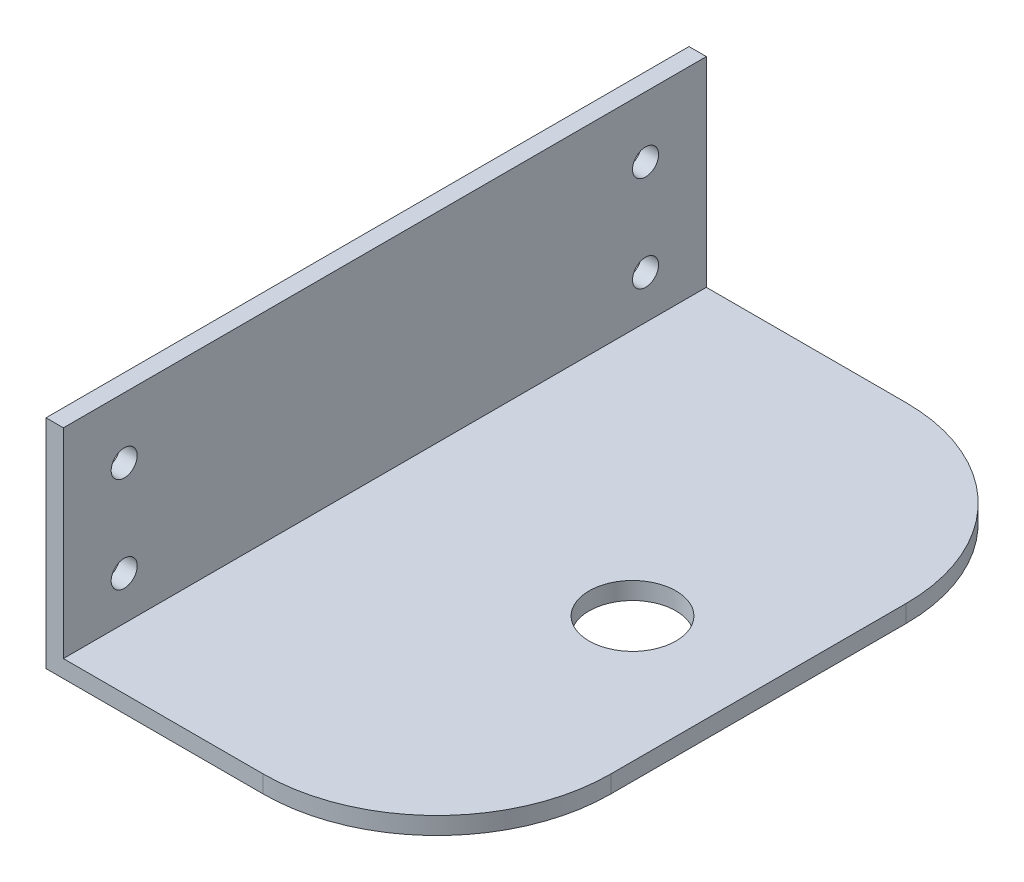
ISO-10303-21;
HEADER;
FILE_DESCRIPTION(('STEP AP214'),'2;1');
FILE_NAME('part.step','',(''),(''),'','','');
FILE_SCHEMA(('AUTOMOTIVE_DESIGN { 1 0 10303 214 1 1 1 1 }'));
ENDSEC;
DATA;
#1=APPLICATION_CONTEXT('core data for automotive mechanical design processes');
#2=APPLICATION_PROTOCOL_DEFINITION('international standard','automotive_design',2000,#1);
#3=PRODUCT_CONTEXT('',#1,'mechanical');
#4=PRODUCT('Part','Part','',(#3));
#5=PRODUCT_RELATED_PRODUCT_CATEGORY('part','',(#4));
#6=PRODUCT_DEFINITION_FORMATION('','',#4);
#7=PRODUCT_DEFINITION_CONTEXT('part definition',#1,'design');
#8=PRODUCT_DEFINITION('design','',#6,#7);
#9=PRODUCT_DEFINITION_SHAPE('','',#8);
#10=(LENGTH_UNIT() NAMED_UNIT(*) SI_UNIT(.MILLI.,.METRE.));
#11=(NAMED_UNIT(*) PLANE_ANGLE_UNIT() SI_UNIT($,.RADIAN.));
#12=(NAMED_UNIT(*) SI_UNIT($,.STERADIAN.) SOLID_ANGLE_UNIT());
#13=UNCERTAINTY_MEASURE_WITH_UNIT(LENGTH_MEASURE(1.E-05),#10,'distance_accuracy_value','');
#14=(GEOMETRIC_REPRESENTATION_CONTEXT(3) GLOBAL_UNCERTAINTY_ASSIGNED_CONTEXT((#13)) GLOBAL_UNIT_ASSIGNED_CONTEXT((#10,
#11,#12)) REPRESENTATION_CONTEXT('',''));
#15=CARTESIAN_POINT('',(0.,0.,0.));
#16=DIRECTION('',(0.,0.,1.));
#17=DIRECTION('',(1.,0.,0.));
#18=AXIS2_PLACEMENT_3D('',#15,#16,#17);
#19=CARTESIAN_POINT('',(0.,2.,0.));
#20=DIRECTION('',(0.,1.,0.));
#21=DIRECTION('',(0.,0.,1.));
#22=AXIS2_PLACEMENT_3D('',#19,#20,#21);
#23=PLANE('',#22);
#24=DIRECTION('',(1.,0.,0.));
#25=VECTOR('',#24,1.);
#26=CARTESIAN_POINT('',(-30.5,2.,37.));
#27=LINE('',#26,#25);
#28=CARTESIAN_POINT('',(-28.5,2.,37.));
#29=VERTEX_POINT('',#28);
#30=CARTESIAN_POINT('',(-5.5,2.,37.));
#31=VERTEX_POINT('',#30);
#32=EDGE_CURVE('E146',#29,#31,#27,.T.);
#33=ORIENTED_EDGE('',*,*,#32,.T.);
#34=CARTESIAN_POINT('',(-5.5,2.,17.));
#35=DIRECTION('',(0.,1.,0.));
#36=DIRECTION('',(0.,0.,1.));
#37=AXIS2_PLACEMENT_3D('',#34,#35,#36);
#38=CIRCLE('',#37,20.);
#39=CARTESIAN_POINT('',(14.5,2.,17.));
#40=VERTEX_POINT('',#39);
#41=EDGE_CURVE('E40',#31,#40,#38,.T.);
#42=ORIENTED_EDGE('',*,*,#41,.T.);
#43=DIRECTION('',(0.,0.,-1.));
#44=VECTOR('',#43,1.);
#45=CARTESIAN_POINT('',(14.5,2.,-37.));
#46=LINE('',#45,#44);
#47=CARTESIAN_POINT('',(14.5,2.,-17.));
#48=VERTEX_POINT('',#47);
#49=EDGE_CURVE('E148',#40,#48,#46,.T.);
#50=ORIENTED_EDGE('',*,*,#49,.T.);
#51=CARTESIAN_POINT('',(-5.5,2.,-17.));
#52=DIRECTION('',(0.,1.,0.));
#53=DIRECTION('',(0.,0.,1.));
#54=AXIS2_PLACEMENT_3D('',#51,#52,#53);
#55=CIRCLE('',#54,20.);
#56=CARTESIAN_POINT('',(-5.50000000000001,2.,-37.));
#57=VERTEX_POINT('',#56);
#58=EDGE_CURVE('E47',#48,#57,#55,.T.);
#59=ORIENTED_EDGE('',*,*,#58,.T.);
#60=DIRECTION('',(-1.,0.,0.));
#61=VECTOR('',#60,1.);
#62=CARTESIAN_POINT('',(-30.5,2.,-37.));
#63=LINE('',#62,#61);
#64=CARTESIAN_POINT('',(-28.5,2.,-37.));
#65=VERTEX_POINT('',#64);
#66=EDGE_CURVE('E151',#57,#65,#63,.T.);
#67=ORIENTED_EDGE('',*,*,#66,.T.);
#68=DIRECTION('',(0.,0.,-1.));
#69=VECTOR('',#68,1.);
#70=CARTESIAN_POINT('',(-28.5,2.,-37.));
#71=LINE('',#70,#69);
#72=EDGE_CURVE('E125',#29,#65,#71,.T.);
#73=ORIENTED_EDGE('',*,*,#72,.F.);
#74=EDGE_LOOP('',(#33,#42,#50,#59,#67,#73));
#75=FACE_BOUND('',#74,.T.);
#76=CARTESIAN_POINT('',(0.,2.,0.));
#77=DIRECTION('',(0.,1.,0.));
#78=DIRECTION('',(0.,0.,1.));
#79=AXIS2_PLACEMENT_3D('',#76,#77,#78);
#80=CIRCLE('',#79,5.);
#81=CARTESIAN_POINT('',(0.,2.,5.));
#82=VERTEX_POINT('',#81);
#83=EDGE_CURVE('E141',#82,#82,#80,.T.);
#84=ORIENTED_EDGE('',*,*,#83,.F.);
#85=EDGE_LOOP('',(#84));
#86=FACE_BOUND('',#85,.T.);
#87=ADVANCED_FACE('F32',(#75,#86),#23,.T.);
#88=CARTESIAN_POINT('',(0.,0.,0.));
#89=DIRECTION('',(0.,1.,0.));
#90=DIRECTION('',(0.,0.,1.));
#91=AXIS2_PLACEMENT_3D('',#88,#89,#90);
#92=PLANE('',#91);
#93=DIRECTION('',(0.,0.,-1.));
#94=VECTOR('',#93,1.);
#95=CARTESIAN_POINT('',(14.5,0.,-37.));
#96=LINE('',#95,#94);
#97=CARTESIAN_POINT('',(14.5,0.,17.));
#98=VERTEX_POINT('',#97);
#99=CARTESIAN_POINT('',(14.5,0.,-17.));
#100=VERTEX_POINT('',#99);
#101=EDGE_CURVE('E156',#98,#100,#96,.T.);
#102=ORIENTED_EDGE('',*,*,#101,.F.);
#103=CARTESIAN_POINT('',(-5.5,0.,17.));
#104=DIRECTION('',(0.,1.,0.));
#105=DIRECTION('',(0.,0.,1.));
#106=AXIS2_PLACEMENT_3D('',#103,#104,#105);
#107=CIRCLE('',#106,20.);
#108=CARTESIAN_POINT('',(-5.5,0.,37.));
#109=VERTEX_POINT('',#108);
#110=EDGE_CURVE('E178',#98,#109,#107,.F.);
#111=ORIENTED_EDGE('',*,*,#110,.T.);
#112=DIRECTION('',(1.,0.,0.));
#113=VECTOR('',#112,1.);
#114=CARTESIAN_POINT('',(-30.5,0.,37.));
#115=LINE('',#114,#113);
#116=CARTESIAN_POINT('',(-30.5,0.,37.));
#117=VERTEX_POINT('',#116);
#118=EDGE_CURVE('E154',#117,#109,#115,.T.);
#119=ORIENTED_EDGE('',*,*,#118,.F.);
#120=DIRECTION('',(0.,0.,1.));
#121=VECTOR('',#120,1.);
#122=CARTESIAN_POINT('',(-30.5,0.,-37.));
#123=LINE('',#122,#121);
#124=CARTESIAN_POINT('',(-30.5,0.,-37.));
#125=VERTEX_POINT('',#124);
#126=EDGE_CURVE('E108',#125,#117,#123,.T.);
#127=ORIENTED_EDGE('',*,*,#126,.F.);
#128=DIRECTION('',(-1.,0.,0.));
#129=VECTOR('',#128,1.);
#130=CARTESIAN_POINT('',(-30.5,0.,-37.));
#131=LINE('',#130,#129);
#132=CARTESIAN_POINT('',(-5.50000000000001,0.,-37.));
#133=VERTEX_POINT('',#132);
#134=EDGE_CURVE('E149',#133,#125,#131,.T.);
#135=ORIENTED_EDGE('',*,*,#134,.F.);
#136=CARTESIAN_POINT('',(-5.5,0.,-17.));
#137=DIRECTION('',(0.,1.,0.));
#138=DIRECTION('',(0.,0.,1.));
#139=AXIS2_PLACEMENT_3D('',#136,#137,#138);
#140=CIRCLE('',#139,20.);
#141=EDGE_CURVE('E176',#133,#100,#140,.F.);
#142=ORIENTED_EDGE('',*,*,#141,.T.);
#143=EDGE_LOOP('',(#102,#111,#119,#127,#135,#142));
#144=FACE_BOUND('',#143,.T.);
#145=CARTESIAN_POINT('',(0.,0.,0.));
#146=DIRECTION('',(0.,1.,0.));
#147=DIRECTION('',(0.,0.,1.));
#148=AXIS2_PLACEMENT_3D('',#145,#146,#147);
#149=CIRCLE('',#148,5.);
#150=CARTESIAN_POINT('',(0.,0.,5.));
#151=VERTEX_POINT('',#150);
#152=EDGE_CURVE('E140',#151,#151,#149,.T.);
#153=ORIENTED_EDGE('',*,*,#152,.T.);
#154=EDGE_LOOP('',(#153));
#155=FACE_BOUND('',#154,.T.);
#156=ADVANCED_FACE('F192',(#144,#155),#92,.F.);
#157=CARTESIAN_POINT('',(-30.5,2.,-37.));
#158=DIRECTION('',(1.,0.,0.));
#159=DIRECTION('',(0.,0.,-1.));
#160=AXIS2_PLACEMENT_3D('',#157,#158,#159);
#161=PLANE('',#160);
#162=CARTESIAN_POINT('',(-30.5,18.,-30.));
#163=DIRECTION('',(1.,0.,0.));
#164=DIRECTION('',(0.,0.,1.));
#165=AXIS2_PLACEMENT_3D('',#162,#163,#164);
#166=CIRCLE('',#165,1.5);
#167=CARTESIAN_POINT('',(-30.5,18.,-28.5));
#168=VERTEX_POINT('',#167);
#169=EDGE_CURVE('E268',#168,#168,#166,.T.);
#170=ORIENTED_EDGE('',*,*,#169,.T.);
#171=EDGE_LOOP('',(#170));
#172=FACE_BOUND('',#171,.T.);
#173=CARTESIAN_POINT('',(-30.5,7.,30.));
#174=DIRECTION('',(1.,0.,0.));
#175=DIRECTION('',(0.,0.,-1.));
#176=AXIS2_PLACEMENT_3D('',#173,#174,#175);
#177=CIRCLE('',#176,1.5);
#178=CARTESIAN_POINT('',(-30.5,7.,28.5));
#179=VERTEX_POINT('',#178);
#180=EDGE_CURVE('E263',#179,#179,#177,.T.);
#181=ORIENTED_EDGE('',*,*,#180,.T.);
#182=EDGE_LOOP('',(#181));
#183=FACE_BOUND('',#182,.T.);
#184=CARTESIAN_POINT('',(-30.5,6.99999999999997,-30.));
#185=DIRECTION('',(1.,0.,0.));
#186=DIRECTION('',(0.,0.,1.));
#187=AXIS2_PLACEMENT_3D('',#184,#185,#186);
#188=CIRCLE('',#187,1.5);
#189=CARTESIAN_POINT('',(-30.5,6.99999999999997,-28.5));
#190=VERTEX_POINT('',#189);
#191=EDGE_CURVE('E261',#190,#190,#188,.T.);
#192=ORIENTED_EDGE('',*,*,#191,.T.);
#193=EDGE_LOOP('',(#192));
#194=FACE_BOUND('',#193,.T.);
#195=CARTESIAN_POINT('',(-30.5,18.,30.));
#196=DIRECTION('',(1.,0.,0.));
#197=DIRECTION('',(0.,0.,-1.));
#198=AXIS2_PLACEMENT_3D('',#195,#196,#197);
#199=CIRCLE('',#198,1.5);
#200=CARTESIAN_POINT('',(-30.5,18.,28.5));
#201=VERTEX_POINT('',#200);
#202=EDGE_CURVE('E131',#201,#201,#199,.T.);
#203=ORIENTED_EDGE('',*,*,#202,.T.);
#204=EDGE_LOOP('',(#203));
#205=FACE_BOUND('',#204,.T.);
#206=ORIENTED_EDGE('',*,*,#126,.T.);
#207=DIRECTION('',(0.,-1.,0.));
#208=VECTOR('',#207,1.);
#209=CARTESIAN_POINT('',(-30.5,2.,37.));
#210=LINE('',#209,#208);
#211=CARTESIAN_POINT('',(-30.5,25.,37.));
#212=VERTEX_POINT('',#211);
#213=EDGE_CURVE('E101',#212,#117,#210,.T.);
#214=ORIENTED_EDGE('',*,*,#213,.F.);
#215=DIRECTION('',(0.,0.,1.));
#216=VECTOR('',#215,1.);
#217=CARTESIAN_POINT('',(-30.5,25.,-37.));
#218=LINE('',#217,#216);
#219=CARTESIAN_POINT('',(-30.5,25.,-37.));
#220=VERTEX_POINT('',#219);
#221=EDGE_CURVE('E106',#220,#212,#218,.T.);
#222=ORIENTED_EDGE('',*,*,#221,.F.);
#223=DIRECTION('',(0.,-1.,0.));
#224=VECTOR('',#223,1.);
#225=CARTESIAN_POINT('',(-30.5,2.,-37.));
#226=LINE('',#225,#224);
#227=EDGE_CURVE('E110',#220,#125,#226,.T.);
#228=ORIENTED_EDGE('',*,*,#227,.T.);
#229=EDGE_LOOP('',(#206,#214,#222,#228));
#230=FACE_BOUND('',#229,.T.);
#231=ADVANCED_FACE('F103',(#172,#183,#194,#205,#230),#161,.F.);
#232=CARTESIAN_POINT('',(-30.5,2.,37.));
#233=DIRECTION('',(0.,0.,-1.));
#234=DIRECTION('',(-1.,0.,0.));
#235=AXIS2_PLACEMENT_3D('',#232,#233,#234);
#236=PLANE('',#235);
#237=ORIENTED_EDGE('',*,*,#118,.T.);
#238=DIRECTION('',(0.,-1.,0.));
#239=VECTOR('',#238,1.);
#240=CARTESIAN_POINT('',(-5.49999999999999,2.,37.));
#241=LINE('',#240,#239);
#242=EDGE_CURVE('E55',#109,#31,#241,.F.);
#243=ORIENTED_EDGE('',*,*,#242,.T.);
#244=ORIENTED_EDGE('',*,*,#32,.F.);
#245=DIRECTION('',(0.,-1.,0.));
#246=VECTOR('',#245,1.);
#247=CARTESIAN_POINT('',(-28.5,25.,37.));
#248=LINE('',#247,#246);
#249=CARTESIAN_POINT('',(-28.5,25.,37.));
#250=VERTEX_POINT('',#249);
#251=EDGE_CURVE('E116',#250,#29,#248,.T.);
#252=ORIENTED_EDGE('',*,*,#251,.F.);
#253=DIRECTION('',(1.,0.,0.));
#254=VECTOR('',#253,1.);
#255=CARTESIAN_POINT('',(-30.5,25.,37.));
#256=LINE('',#255,#254);
#257=EDGE_CURVE('E113',#212,#250,#256,.T.);
#258=ORIENTED_EDGE('',*,*,#257,.F.);
#259=ORIENTED_EDGE('',*,*,#213,.T.);
#260=EDGE_LOOP('',(#237,#243,#244,#252,#258,#259));
#261=FACE_BOUND('',#260,.T.);
#262=ADVANCED_FACE('F114',(#261),#236,.F.);
#263=CARTESIAN_POINT('',(14.5,2.,-37.));
#264=DIRECTION('',(-1.,0.,0.));
#265=DIRECTION('',(0.,0.,1.));
#266=AXIS2_PLACEMENT_3D('',#263,#264,#265);
#267=PLANE('',#266);
#268=ORIENTED_EDGE('',*,*,#49,.F.);
#269=DIRECTION('',(0.,-1.,0.));
#270=VECTOR('',#269,1.);
#271=CARTESIAN_POINT('',(14.5,2.,17.));
#272=LINE('',#271,#270);
#273=EDGE_CURVE('E173',#40,#98,#272,.T.);
#274=ORIENTED_EDGE('',*,*,#273,.T.);
#275=ORIENTED_EDGE('',*,*,#101,.T.);
#276=DIRECTION('',(0.,-1.,0.));
#277=VECTOR('',#276,1.);
#278=CARTESIAN_POINT('',(14.5,2.,-17.));
#279=LINE('',#278,#277);
#280=EDGE_CURVE('E109',#100,#48,#279,.F.);
#281=ORIENTED_EDGE('',*,*,#280,.T.);
#282=EDGE_LOOP('',(#268,#274,#275,#281));
#283=FACE_BOUND('',#282,.T.);
#284=ADVANCED_FACE('F187',(#283),#267,.F.);
#285=CARTESIAN_POINT('',(-30.5,2.,-37.));
#286=DIRECTION('',(0.,0.,1.));
#287=DIRECTION('',(1.,0.,0.));
#288=AXIS2_PLACEMENT_3D('',#285,#286,#287);
#289=PLANE('',#288);
#290=ORIENTED_EDGE('',*,*,#66,.F.);
#291=DIRECTION('',(0.,-1.,0.));
#292=VECTOR('',#291,1.);
#293=CARTESIAN_POINT('',(-5.5,2.,-37.));
#294=LINE('',#293,#292);
#295=EDGE_CURVE('E11',#57,#133,#294,.T.);
#296=ORIENTED_EDGE('',*,*,#295,.T.);
#297=ORIENTED_EDGE('',*,*,#134,.T.);
#298=ORIENTED_EDGE('',*,*,#227,.F.);
#299=DIRECTION('',(-1.,0.,0.));
#300=VECTOR('',#299,1.);
#301=CARTESIAN_POINT('',(-30.5,25.,-37.));
#302=LINE('',#301,#300);
#303=CARTESIAN_POINT('',(-28.5,25.,-37.));
#304=VERTEX_POINT('',#303);
#305=EDGE_CURVE('E124',#304,#220,#302,.T.);
#306=ORIENTED_EDGE('',*,*,#305,.F.);
#307=DIRECTION('',(0.,-1.,0.));
#308=VECTOR('',#307,1.);
#309=CARTESIAN_POINT('',(-28.5,25.,-37.));
#310=LINE('',#309,#308);
#311=EDGE_CURVE('E135',#304,#65,#310,.T.);
#312=ORIENTED_EDGE('',*,*,#311,.T.);
#313=EDGE_LOOP('',(#290,#296,#297,#298,#306,#312));
#314=FACE_BOUND('',#313,.T.);
#315=ADVANCED_FACE('F198',(#314),#289,.F.);
#316=CARTESIAN_POINT('',(0.,2.,0.));
#317=DIRECTION('',(0.,-1.,0.));
#318=DIRECTION('',(0.,0.,-1.));
#319=AXIS2_PLACEMENT_3D('',#316,#317,#318);
#320=CYLINDRICAL_SURFACE('',#319,5.);
#321=ORIENTED_EDGE('',*,*,#83,.T.);
#322=EDGE_LOOP('',(#321));
#323=FACE_BOUND('',#322,.T.);
#324=ORIENTED_EDGE('',*,*,#152,.F.);
#325=EDGE_LOOP('',(#324));
#326=FACE_BOUND('',#325,.T.);
#327=ADVANCED_FACE('F203',(#323,#326),#320,.F.);
#328=CARTESIAN_POINT('',(-28.5,25.,-37.));
#329=DIRECTION('',(-1.,0.,0.));
#330=DIRECTION('',(0.,0.,1.));
#331=AXIS2_PLACEMENT_3D('',#328,#329,#330);
#332=PLANE('',#331);
#333=CARTESIAN_POINT('',(-28.5,18.,-30.));
#334=DIRECTION('',(-1.,0.,0.));
#335=DIRECTION('',(0.,0.,1.));
#336=AXIS2_PLACEMENT_3D('',#333,#334,#335);
#337=CIRCLE('',#336,1.5);
#338=CARTESIAN_POINT('',(-28.5,18.,-28.5));
#339=VERTEX_POINT('',#338);
#340=EDGE_CURVE('E128',#339,#339,#337,.T.);
#341=ORIENTED_EDGE('',*,*,#340,.T.);
#342=EDGE_LOOP('',(#341));
#343=FACE_BOUND('',#342,.T.);
#344=CARTESIAN_POINT('',(-28.5,7.,30.));
#345=DIRECTION('',(-1.,0.,0.));
#346=DIRECTION('',(0.,0.,1.));
#347=AXIS2_PLACEMENT_3D('',#344,#345,#346);
#348=CIRCLE('',#347,1.5);
#349=CARTESIAN_POINT('',(-28.5,7.,31.5));
#350=VERTEX_POINT('',#349);
#351=EDGE_CURVE('E167',#350,#350,#348,.T.);
#352=ORIENTED_EDGE('',*,*,#351,.T.);
#353=EDGE_LOOP('',(#352));
#354=FACE_BOUND('',#353,.T.);
#355=CARTESIAN_POINT('',(-28.5,6.99999999999997,-30.));
#356=DIRECTION('',(-1.,0.,0.));
#357=DIRECTION('',(0.,0.,1.));
#358=AXIS2_PLACEMENT_3D('',#355,#356,#357);
#359=CIRCLE('',#358,1.5);
#360=CARTESIAN_POINT('',(-28.5,6.99999999999997,-28.5));
#361=VERTEX_POINT('',#360);
#362=EDGE_CURVE('E164',#361,#361,#359,.T.);
#363=ORIENTED_EDGE('',*,*,#362,.T.);
#364=EDGE_LOOP('',(#363));
#365=FACE_BOUND('',#364,.T.);
#366=CARTESIAN_POINT('',(-28.5,18.,30.));
#367=DIRECTION('',(-1.,0.,0.));
#368=DIRECTION('',(0.,0.,1.));
#369=AXIS2_PLACEMENT_3D('',#366,#367,#368);
#370=CIRCLE('',#369,1.5);
#371=CARTESIAN_POINT('',(-28.5,18.,31.5));
#372=VERTEX_POINT('',#371);
#373=EDGE_CURVE('E161',#372,#372,#370,.T.);
#374=ORIENTED_EDGE('',*,*,#373,.T.);
#375=EDGE_LOOP('',(#374));
#376=FACE_BOUND('',#375,.T.);
#377=ORIENTED_EDGE('',*,*,#72,.T.);
#378=ORIENTED_EDGE('',*,*,#311,.F.);
#379=DIRECTION('',(0.,0.,-1.));
#380=VECTOR('',#379,1.);
#381=CARTESIAN_POINT('',(-28.5,25.,-37.));
#382=LINE('',#381,#380);
#383=EDGE_CURVE('E119',#250,#304,#382,.T.);
#384=ORIENTED_EDGE('',*,*,#383,.F.);
#385=ORIENTED_EDGE('',*,*,#251,.T.);
#386=EDGE_LOOP('',(#377,#378,#384,#385));
#387=FACE_BOUND('',#386,.T.);
#388=ADVANCED_FACE('F201',(#343,#354,#365,#376,#387),#332,.F.);
#389=CARTESIAN_POINT('',(0.,25.,0.));
#390=DIRECTION('',(0.,1.,0.));
#391=DIRECTION('',(0.,0.,1.));
#392=AXIS2_PLACEMENT_3D('',#389,#390,#391);
#393=PLANE('',#392);
#394=ORIENTED_EDGE('',*,*,#221,.T.);
#395=ORIENTED_EDGE('',*,*,#257,.T.);
#396=ORIENTED_EDGE('',*,*,#383,.T.);
#397=ORIENTED_EDGE('',*,*,#305,.T.);
#398=EDGE_LOOP('',(#394,#395,#396,#397));
#399=FACE_BOUND('',#398,.T.);
#400=ADVANCED_FACE('F122',(#399),#393,.T.);
#401=CARTESIAN_POINT('',(-30.5,18.,30.));
#402=DIRECTION('',(1.,0.,0.));
#403=DIRECTION('',(0.,0.,-1.));
#404=AXIS2_PLACEMENT_3D('',#401,#402,#403);
#405=CYLINDRICAL_SURFACE('',#404,1.5);
#406=ORIENTED_EDGE('',*,*,#202,.F.);
#407=EDGE_LOOP('',(#406));
#408=FACE_BOUND('',#407,.T.);
#409=ORIENTED_EDGE('',*,*,#373,.F.);
#410=EDGE_LOOP('',(#409));
#411=FACE_BOUND('',#410,.T.);
#412=ADVANCED_FACE('F210',(#408,#411),#405,.F.);
#413=CARTESIAN_POINT('',(-30.5,6.99999999999997,-30.));
#414=DIRECTION('',(1.,0.,0.));
#415=DIRECTION('',(0.,0.,-1.));
#416=AXIS2_PLACEMENT_3D('',#413,#414,#415);
#417=CYLINDRICAL_SURFACE('',#416,1.5);
#418=ORIENTED_EDGE('',*,*,#191,.F.);
#419=EDGE_LOOP('',(#418));
#420=FACE_BOUND('',#419,.T.);
#421=ORIENTED_EDGE('',*,*,#362,.F.);
#422=EDGE_LOOP('',(#421));
#423=FACE_BOUND('',#422,.T.);
#424=ADVANCED_FACE('F242',(#420,#423),#417,.F.);
#425=CARTESIAN_POINT('',(-30.5,7.,30.));
#426=DIRECTION('',(1.,0.,0.));
#427=DIRECTION('',(0.,0.,-1.));
#428=AXIS2_PLACEMENT_3D('',#425,#426,#427);
#429=CYLINDRICAL_SURFACE('',#428,1.5);
#430=ORIENTED_EDGE('',*,*,#180,.F.);
#431=EDGE_LOOP('',(#430));
#432=FACE_BOUND('',#431,.T.);
#433=ORIENTED_EDGE('',*,*,#351,.F.);
#434=EDGE_LOOP('',(#433));
#435=FACE_BOUND('',#434,.T.);
#436=ADVANCED_FACE('F236',(#432,#435),#429,.F.);
#437=CARTESIAN_POINT('',(-30.5,18.,-30.));
#438=DIRECTION('',(1.,0.,0.));
#439=DIRECTION('',(0.,0.,-1.));
#440=AXIS2_PLACEMENT_3D('',#437,#438,#439);
#441=CYLINDRICAL_SURFACE('',#440,1.5);
#442=ORIENTED_EDGE('',*,*,#169,.F.);
#443=EDGE_LOOP('',(#442));
#444=FACE_BOUND('',#443,.T.);
#445=ORIENTED_EDGE('',*,*,#340,.F.);
#446=EDGE_LOOP('',(#445));
#447=FACE_BOUND('',#446,.T.);
#448=ADVANCED_FACE('F231',(#444,#447),#441,.F.);
#449=CARTESIAN_POINT('',(-5.5,2.,17.));
#450=DIRECTION('',(0.,-1.,0.));
#451=DIRECTION('',(0.,0.,-1.));
#452=AXIS2_PLACEMENT_3D('',#449,#450,#451);
#453=CYLINDRICAL_SURFACE('',#452,20.);
#454=ORIENTED_EDGE('',*,*,#41,.F.);
#455=ORIENTED_EDGE('',*,*,#242,.F.);
#456=ORIENTED_EDGE('',*,*,#110,.F.);
#457=ORIENTED_EDGE('',*,*,#273,.F.);
#458=EDGE_LOOP('',(#454,#455,#456,#457));
#459=FACE_BOUND('',#458,.T.);
#460=ADVANCED_FACE('F190',(#459),#453,.T.);
#461=CARTESIAN_POINT('',(-5.5,2.,-17.));
#462=DIRECTION('',(0.,-1.,0.));
#463=DIRECTION('',(0.,0.,-1.));
#464=AXIS2_PLACEMENT_3D('',#461,#462,#463);
#465=CYLINDRICAL_SURFACE('',#464,20.);
#466=ORIENTED_EDGE('',*,*,#58,.F.);
#467=ORIENTED_EDGE('',*,*,#280,.F.);
#468=ORIENTED_EDGE('',*,*,#141,.F.);
#469=ORIENTED_EDGE('',*,*,#295,.F.);
#470=EDGE_LOOP('',(#466,#467,#468,#469));
#471=FACE_BOUND('',#470,.T.);
#472=ADVANCED_FACE('F34',(#471),#465,.T.);
#473=CLOSED_SHELL('',(#87,#156,#231,#262,#284,#315,#327,#388,#400,#412,#424,#436,#448,#460,#472));
#474=MANIFOLD_SOLID_BREP('B2',#473);
#475=ADVANCED_BREP_SHAPE_REPRESENTATION('',(#18,#474),#14);
#476=SHAPE_DEFINITION_REPRESENTATION(#9,#475);
ENDSEC;
END-ISO-10303-21;
